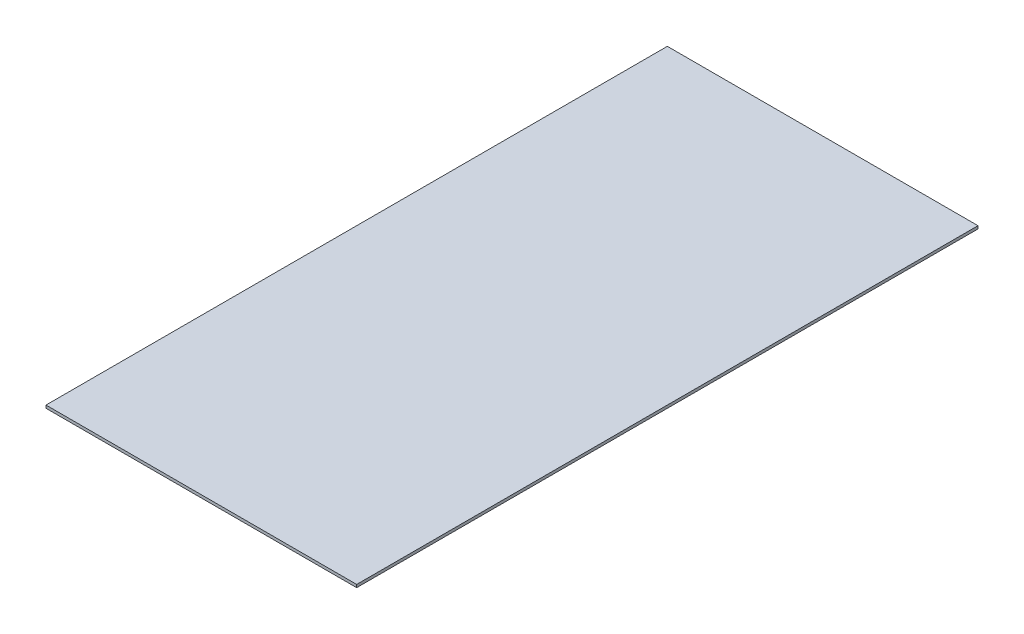
ISO-10303-21;
HEADER;
FILE_DESCRIPTION(('STEP AP214'),'2;1');
FILE_NAME('part.step','',(''),(''),'','','');
FILE_SCHEMA(('AUTOMOTIVE_DESIGN { 1 0 10303 214 1 1 1 1 }'));
ENDSEC;
DATA;
#1=APPLICATION_CONTEXT('core data for automotive mechanical design processes');
#2=APPLICATION_PROTOCOL_DEFINITION('international standard','automotive_design',2000,#1);
#3=PRODUCT_CONTEXT('',#1,'mechanical');
#4=PRODUCT('Part','Part','',(#3));
#5=PRODUCT_RELATED_PRODUCT_CATEGORY('part','',(#4));
#6=PRODUCT_DEFINITION_FORMATION('','',#4);
#7=PRODUCT_DEFINITION_CONTEXT('part definition',#1,'design');
#8=PRODUCT_DEFINITION('design','',#6,#7);
#9=PRODUCT_DEFINITION_SHAPE('','',#8);
#10=(LENGTH_UNIT() NAMED_UNIT(*) SI_UNIT(.MILLI.,.METRE.));
#11=(NAMED_UNIT(*) PLANE_ANGLE_UNIT() SI_UNIT($,.RADIAN.));
#12=(NAMED_UNIT(*) SI_UNIT($,.STERADIAN.) SOLID_ANGLE_UNIT());
#13=UNCERTAINTY_MEASURE_WITH_UNIT(LENGTH_MEASURE(1.E-05),#10,'distance_accuracy_value','');
#14=(GEOMETRIC_REPRESENTATION_CONTEXT(3) GLOBAL_UNCERTAINTY_ASSIGNED_CONTEXT((#13)) GLOBAL_UNIT_ASSIGNED_CONTEXT((#10,
#11,#12)) REPRESENTATION_CONTEXT('',''));
#15=CARTESIAN_POINT('',(0.,0.,0.));
#16=DIRECTION('',(0.,0.,1.));
#17=DIRECTION('',(1.,0.,0.));
#18=AXIS2_PLACEMENT_3D('',#15,#16,#17);
#19=CARTESIAN_POINT('',(304.8,5.55625,609.6));
#20=DIRECTION('',(-1.,0.,0.));
#21=DIRECTION('',(0.,0.,1.));
#22=AXIS2_PLACEMENT_3D('',#19,#20,#21);
#23=PLANE('',#22);
#24=DIRECTION('',(0.,0.,-1.));
#25=VECTOR('',#24,1.);
#26=CARTESIAN_POINT('',(304.8,0.,609.6));
#27=LINE('',#26,#25);
#28=CARTESIAN_POINT('',(304.8,0.,609.6));
#29=VERTEX_POINT('',#28);
#30=CARTESIAN_POINT('',(304.8,0.,-609.6));
#31=VERTEX_POINT('',#30);
#32=EDGE_CURVE('E100',#29,#31,#27,.T.);
#33=ORIENTED_EDGE('',*,*,#32,.T.);
#34=DIRECTION('',(0.,-1.,0.));
#35=VECTOR('',#34,1.);
#36=CARTESIAN_POINT('',(304.8,5.55625,-609.6));
#37=LINE('',#36,#35);
#38=CARTESIAN_POINT('',(304.8,5.55625,-609.6));
#39=VERTEX_POINT('',#38);
#40=EDGE_CURVE('E11',#39,#31,#37,.T.);
#41=ORIENTED_EDGE('',*,*,#40,.F.);
#42=DIRECTION('',(0.,0.,-1.));
#43=VECTOR('',#42,1.);
#44=CARTESIAN_POINT('',(304.8,5.55625,609.6));
#45=LINE('',#44,#43);
#46=CARTESIAN_POINT('',(304.8,5.55625,609.6));
#47=VERTEX_POINT('',#46);
#48=EDGE_CURVE('E88',#47,#39,#45,.T.);
#49=ORIENTED_EDGE('',*,*,#48,.F.);
#50=DIRECTION('',(0.,-1.,0.));
#51=VECTOR('',#50,1.);
#52=CARTESIAN_POINT('',(304.8,5.55625,609.6));
#53=LINE('',#52,#51);
#54=EDGE_CURVE('E96',#47,#29,#53,.T.);
#55=ORIENTED_EDGE('',*,*,#54,.T.);
#56=EDGE_LOOP('',(#33,#41,#49,#55));
#57=FACE_BOUND('',#56,.T.);
#58=ADVANCED_FACE('F37',(#57),#23,.F.);
#59=CARTESIAN_POINT('',(-304.8,5.55625,-609.6));
#60=DIRECTION('',(0.,0.,1.));
#61=DIRECTION('',(1.,0.,0.));
#62=AXIS2_PLACEMENT_3D('',#59,#60,#61);
#63=PLANE('',#62);
#64=DIRECTION('',(-1.,0.,0.));
#65=VECTOR('',#64,1.);
#66=CARTESIAN_POINT('',(-304.8,0.,-609.6));
#67=LINE('',#66,#65);
#68=CARTESIAN_POINT('',(-304.8,0.,-609.6));
#69=VERTEX_POINT('',#68);
#70=EDGE_CURVE('E92',#31,#69,#67,.T.);
#71=ORIENTED_EDGE('',*,*,#70,.T.);
#72=DIRECTION('',(0.,-1.,0.));
#73=VECTOR('',#72,1.);
#74=CARTESIAN_POINT('',(-304.8,5.55625,-609.6));
#75=LINE('',#74,#73);
#76=CARTESIAN_POINT('',(-304.8,5.55625,-609.6));
#77=VERTEX_POINT('',#76);
#78=EDGE_CURVE('E45',#77,#69,#75,.T.);
#79=ORIENTED_EDGE('',*,*,#78,.F.);
#80=DIRECTION('',(-1.,0.,0.));
#81=VECTOR('',#80,1.);
#82=CARTESIAN_POINT('',(-304.8,5.55625,-609.6));
#83=LINE('',#82,#81);
#84=EDGE_CURVE('E83',#39,#77,#83,.T.);
#85=ORIENTED_EDGE('',*,*,#84,.F.);
#86=ORIENTED_EDGE('',*,*,#40,.T.);
#87=EDGE_LOOP('',(#71,#79,#85,#86));
#88=FACE_BOUND('',#87,.T.);
#89=ADVANCED_FACE('F91',(#88),#63,.F.);
#90=CARTESIAN_POINT('',(-304.8,5.55625,609.6));
#91=DIRECTION('',(1.,0.,0.));
#92=DIRECTION('',(0.,0.,-1.));
#93=AXIS2_PLACEMENT_3D('',#90,#91,#92);
#94=PLANE('',#93);
#95=DIRECTION('',(0.,0.,1.));
#96=VECTOR('',#95,1.);
#97=CARTESIAN_POINT('',(-304.8,0.,609.6));
#98=LINE('',#97,#96);
#99=CARTESIAN_POINT('',(-304.8,0.,609.6));
#100=VERTEX_POINT('',#99);
#101=EDGE_CURVE('E70',#69,#100,#98,.T.);
#102=ORIENTED_EDGE('',*,*,#101,.T.);
#103=DIRECTION('',(0.,-1.,0.));
#104=VECTOR('',#103,1.);
#105=CARTESIAN_POINT('',(-304.8,5.55625,609.6));
#106=LINE('',#105,#104);
#107=CARTESIAN_POINT('',(-304.8,5.55625,609.6));
#108=VERTEX_POINT('',#107);
#109=EDGE_CURVE('E93',#108,#100,#106,.T.);
#110=ORIENTED_EDGE('',*,*,#109,.F.);
#111=DIRECTION('',(0.,0.,1.));
#112=VECTOR('',#111,1.);
#113=CARTESIAN_POINT('',(-304.8,5.55625,609.6));
#114=LINE('',#113,#112);
#115=EDGE_CURVE('E86',#77,#108,#114,.T.);
#116=ORIENTED_EDGE('',*,*,#115,.F.);
#117=ORIENTED_EDGE('',*,*,#78,.T.);
#118=EDGE_LOOP('',(#102,#110,#116,#117));
#119=FACE_BOUND('',#118,.T.);
#120=ADVANCED_FACE('F94',(#119),#94,.F.);
#121=CARTESIAN_POINT('',(-304.8,5.55625,609.6));
#122=DIRECTION('',(0.,0.,-1.));
#123=DIRECTION('',(-1.,0.,0.));
#124=AXIS2_PLACEMENT_3D('',#121,#122,#123);
#125=PLANE('',#124);
#126=DIRECTION('',(1.,0.,0.));
#127=VECTOR('',#126,1.);
#128=CARTESIAN_POINT('',(-304.8,0.,609.6));
#129=LINE('',#128,#127);
#130=EDGE_CURVE('E76',#100,#29,#129,.T.);
#131=ORIENTED_EDGE('',*,*,#130,.T.);
#132=ORIENTED_EDGE('',*,*,#54,.F.);
#133=DIRECTION('',(1.,0.,0.));
#134=VECTOR('',#133,1.);
#135=CARTESIAN_POINT('',(-304.8,5.55625,609.6));
#136=LINE('',#135,#134);
#137=EDGE_CURVE('E53',#108,#47,#136,.T.);
#138=ORIENTED_EDGE('',*,*,#137,.F.);
#139=ORIENTED_EDGE('',*,*,#109,.T.);
#140=EDGE_LOOP('',(#131,#132,#138,#139));
#141=FACE_BOUND('',#140,.T.);
#142=ADVANCED_FACE('F107',(#141),#125,.F.);
#143=CARTESIAN_POINT('',(0.,5.55625,0.));
#144=DIRECTION('',(0.,-1.,0.));
#145=DIRECTION('',(0.,0.,-1.));
#146=AXIS2_PLACEMENT_3D('',#143,#144,#145);
#147=PLANE('',#146);
#148=ORIENTED_EDGE('',*,*,#48,.T.);
#149=ORIENTED_EDGE('',*,*,#84,.T.);
#150=ORIENTED_EDGE('',*,*,#115,.T.);
#151=ORIENTED_EDGE('',*,*,#137,.T.);
#152=EDGE_LOOP('',(#148,#149,#150,#151));
#153=FACE_BOUND('',#152,.T.);
#154=ADVANCED_FACE('F84',(#153),#147,.F.);
#155=CARTESIAN_POINT('',(0.,0.,0.));
#156=DIRECTION('',(0.,-1.,0.));
#157=DIRECTION('',(0.,0.,-1.));
#158=AXIS2_PLACEMENT_3D('',#155,#156,#157);
#159=PLANE('',#158);
#160=ORIENTED_EDGE('',*,*,#32,.F.);
#161=ORIENTED_EDGE('',*,*,#130,.F.);
#162=ORIENTED_EDGE('',*,*,#101,.F.);
#163=ORIENTED_EDGE('',*,*,#70,.F.);
#164=EDGE_LOOP('',(#160,#161,#162,#163));
#165=FACE_BOUND('',#164,.T.);
#166=ADVANCED_FACE('F110',(#165),#159,.T.);
#167=CLOSED_SHELL('',(#58,#89,#120,#142,#154,#166));
#168=MANIFOLD_SOLID_BREP('B2',#167);
#169=ADVANCED_BREP_SHAPE_REPRESENTATION('',(#18,#168),#14);
#170=SHAPE_DEFINITION_REPRESENTATION(#9,#169);
ENDSEC;
END-ISO-10303-21;
